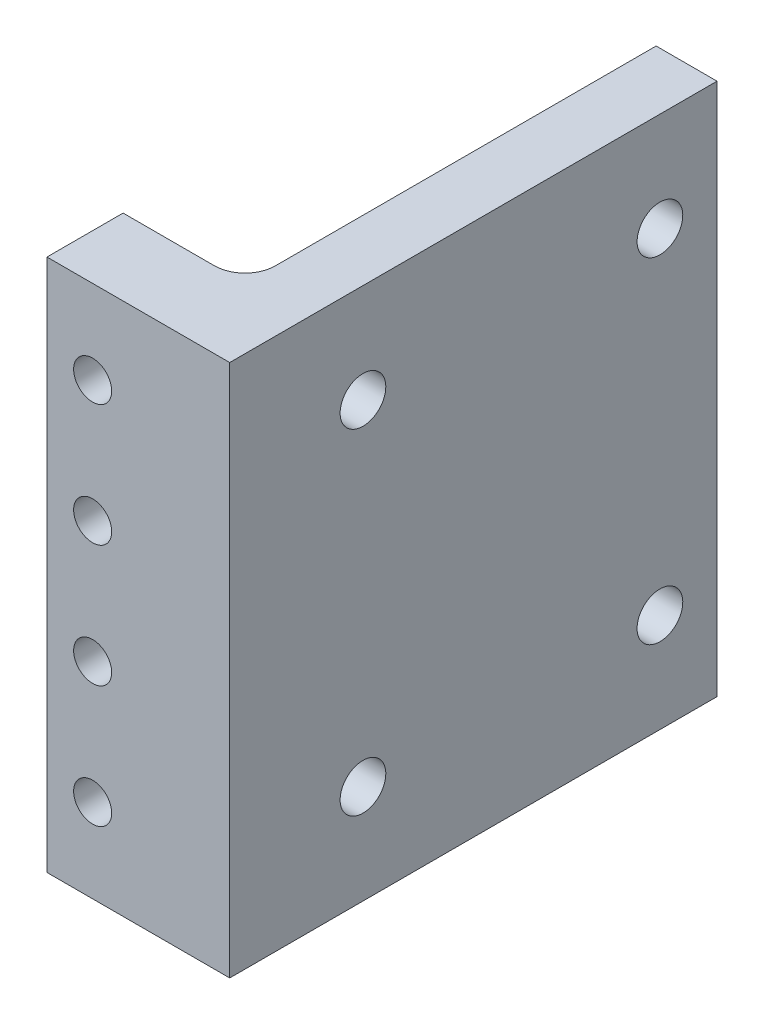
ISO-10303-21;
HEADER;
FILE_DESCRIPTION(('STEP AP214'),'2;1');
FILE_NAME('part.step','',(''),(''),'','','');
FILE_SCHEMA(('AUTOMOTIVE_DESIGN { 1 0 10303 214 1 1 1 1 }'));
ENDSEC;
DATA;
#1=APPLICATION_CONTEXT('core data for automotive mechanical design processes');
#2=APPLICATION_PROTOCOL_DEFINITION('international standard','automotive_design',2000,#1);
#3=PRODUCT_CONTEXT('',#1,'mechanical');
#4=PRODUCT('Part','Part','',(#3));
#5=PRODUCT_RELATED_PRODUCT_CATEGORY('part','',(#4));
#6=PRODUCT_DEFINITION_FORMATION('','',#4);
#7=PRODUCT_DEFINITION_CONTEXT('part definition',#1,'design');
#8=PRODUCT_DEFINITION('design','',#6,#7);
#9=PRODUCT_DEFINITION_SHAPE('','',#8);
#10=(LENGTH_UNIT() NAMED_UNIT(*) SI_UNIT(.MILLI.,.METRE.));
#11=(NAMED_UNIT(*) PLANE_ANGLE_UNIT() SI_UNIT($,.RADIAN.));
#12=(NAMED_UNIT(*) SI_UNIT($,.STERADIAN.) SOLID_ANGLE_UNIT());
#13=UNCERTAINTY_MEASURE_WITH_UNIT(LENGTH_MEASURE(1.E-05),#10,'distance_accuracy_value','');
#14=(GEOMETRIC_REPRESENTATION_CONTEXT(3) GLOBAL_UNCERTAINTY_ASSIGNED_CONTEXT((#13)) GLOBAL_UNIT_ASSIGNED_CONTEXT((#10,
#11,#12)) REPRESENTATION_CONTEXT('',''));
#15=CARTESIAN_POINT('',(0.,0.,0.));
#16=DIRECTION('',(0.,0.,1.));
#17=DIRECTION('',(1.,0.,0.));
#18=AXIS2_PLACEMENT_3D('',#15,#16,#17);
#19=CARTESIAN_POINT('',(0.,0.,0.));
#20=DIRECTION('',(0.,0.,1.));
#21=DIRECTION('',(1.,0.,0.));
#22=AXIS2_PLACEMENT_3D('',#19,#20,#21);
#23=PLANE('',#22);
#24=CARTESIAN_POINT('',(3.00000000000008,5.5,0.));
#25=DIRECTION('',(0.,0.,1.));
#26=DIRECTION('',(1.,0.,0.));
#27=AXIS2_PLACEMENT_3D('',#24,#25,#26);
#28=CIRCLE('',#27,1.25);
#29=CARTESIAN_POINT('',(4.25000000000008,5.5,0.));
#30=VERTEX_POINT('',#29);
#31=EDGE_CURVE('E126',#30,#30,#28,.T.);
#32=ORIENTED_EDGE('',*,*,#31,.T.);
#33=EDGE_LOOP('',(#32));
#34=FACE_BOUND('',#33,.T.);
#35=CARTESIAN_POINT('',(3.00000000000006,13.5,0.));
#36=DIRECTION('',(0.,0.,1.));
#37=DIRECTION('',(1.,0.,0.));
#38=AXIS2_PLACEMENT_3D('',#35,#36,#37);
#39=CIRCLE('',#38,1.25);
#40=CARTESIAN_POINT('',(4.25000000000006,13.5,0.));
#41=VERTEX_POINT('',#40);
#42=EDGE_CURVE('E131',#41,#41,#39,.T.);
#43=ORIENTED_EDGE('',*,*,#42,.T.);
#44=EDGE_LOOP('',(#43));
#45=FACE_BOUND('',#44,.T.);
#46=CARTESIAN_POINT('',(3.00000000000003,21.5,0.));
#47=DIRECTION('',(0.,0.,1.));
#48=DIRECTION('',(1.,0.,0.));
#49=AXIS2_PLACEMENT_3D('',#46,#47,#48);
#50=CIRCLE('',#49,1.25);
#51=CARTESIAN_POINT('',(4.25000000000003,21.5,0.));
#52=VERTEX_POINT('',#51);
#53=EDGE_CURVE('E278',#52,#52,#50,.T.);
#54=ORIENTED_EDGE('',*,*,#53,.T.);
#55=EDGE_LOOP('',(#54));
#56=FACE_BOUND('',#55,.T.);
#57=CARTESIAN_POINT('',(3.,29.5,0.));
#58=DIRECTION('',(0.,0.,1.));
#59=DIRECTION('',(1.,0.,0.));
#60=AXIS2_PLACEMENT_3D('',#57,#58,#59);
#61=CIRCLE('',#60,1.25);
#62=CARTESIAN_POINT('',(4.25,29.5,0.));
#63=VERTEX_POINT('',#62);
#64=EDGE_CURVE('E283',#63,#63,#61,.T.);
#65=ORIENTED_EDGE('',*,*,#64,.T.);
#66=EDGE_LOOP('',(#65));
#67=FACE_BOUND('',#66,.T.);
#68=DIRECTION('',(-1.,0.,0.));
#69=VECTOR('',#68,1.);
#70=CARTESIAN_POINT('',(0.,35.,0.));
#71=LINE('',#70,#69);
#72=CARTESIAN_POINT('',(6.,35.,0.));
#73=VERTEX_POINT('',#72);
#74=CARTESIAN_POINT('',(0.,35.,0.));
#75=VERTEX_POINT('',#74);
#76=EDGE_CURVE('E150',#73,#75,#71,.T.);
#77=ORIENTED_EDGE('',*,*,#76,.F.);
#78=DIRECTION('',(0.,1.,0.));
#79=VECTOR('',#78,1.);
#80=CARTESIAN_POINT('',(6.,0.,0.));
#81=LINE('',#80,#79);
#82=CARTESIAN_POINT('',(6.,0.,0.));
#83=VERTEX_POINT('',#82);
#84=EDGE_CURVE('E62',#73,#83,#81,.F.);
#85=ORIENTED_EDGE('',*,*,#84,.T.);
#86=DIRECTION('',(1.,0.,0.));
#87=VECTOR('',#86,1.);
#88=CARTESIAN_POINT('',(0.,0.,0.));
#89=LINE('',#88,#87);
#90=CARTESIAN_POINT('',(0.,0.,0.));
#91=VERTEX_POINT('',#90);
#92=EDGE_CURVE('E162',#91,#83,#89,.T.);
#93=ORIENTED_EDGE('',*,*,#92,.F.);
#94=DIRECTION('',(0.,-1.,0.));
#95=VECTOR('',#94,1.);
#96=CARTESIAN_POINT('',(0.,35.,0.));
#97=LINE('',#96,#95);
#98=EDGE_CURVE('E144',#75,#91,#97,.T.);
#99=ORIENTED_EDGE('',*,*,#98,.F.);
#100=EDGE_LOOP('',(#77,#85,#93,#99));
#101=FACE_BOUND('',#100,.T.);
#102=ADVANCED_FACE('F40',(#34,#45,#56,#67,#101),#23,.F.);
#103=CARTESIAN_POINT('',(0.,35.,5.));
#104=DIRECTION('',(1.,0.,0.));
#105=DIRECTION('',(0.,1.,0.));
#106=AXIS2_PLACEMENT_3D('',#103,#104,#105);
#107=PLANE('',#106);
#108=ORIENTED_EDGE('',*,*,#98,.T.);
#109=DIRECTION('',(0.,0.,-1.));
#110=VECTOR('',#109,1.);
#111=CARTESIAN_POINT('',(0.,0.,5.));
#112=LINE('',#111,#110);
#113=CARTESIAN_POINT('',(0.,0.,5.));
#114=VERTEX_POINT('',#113);
#115=EDGE_CURVE('E108',#114,#91,#112,.T.);
#116=ORIENTED_EDGE('',*,*,#115,.F.);
#117=DIRECTION('',(0.,-1.,0.));
#118=VECTOR('',#117,1.);
#119=CARTESIAN_POINT('',(0.,35.,5.));
#120=LINE('',#119,#118);
#121=CARTESIAN_POINT('',(0.,35.,5.));
#122=VERTEX_POINT('',#121);
#123=EDGE_CURVE('E145',#122,#114,#120,.T.);
#124=ORIENTED_EDGE('',*,*,#123,.F.);
#125=DIRECTION('',(0.,0.,-1.));
#126=VECTOR('',#125,1.);
#127=CARTESIAN_POINT('',(0.,35.,5.));
#128=LINE('',#127,#126);
#129=EDGE_CURVE('E158',#122,#75,#128,.T.);
#130=ORIENTED_EDGE('',*,*,#129,.T.);
#131=EDGE_LOOP('',(#108,#116,#124,#130));
#132=FACE_BOUND('',#131,.T.);
#133=ADVANCED_FACE('F418',(#132),#107,.F.);
#134=CARTESIAN_POINT('',(0.,0.,5.));
#135=DIRECTION('',(0.,1.,0.));
#136=DIRECTION('',(0.,0.,1.));
#137=AXIS2_PLACEMENT_3D('',#134,#135,#136);
#138=PLANE('',#137);
#139=ORIENTED_EDGE('',*,*,#92,.T.);
#140=CARTESIAN_POINT('',(6.,0.,-2.));
#141=DIRECTION('',(0.,1.,0.));
#142=DIRECTION('',(0.,0.,1.));
#143=AXIS2_PLACEMENT_3D('',#140,#141,#142);
#144=CIRCLE('',#143,2.);
#145=CARTESIAN_POINT('',(8.,0.,-2.));
#146=VERTEX_POINT('',#145);
#147=EDGE_CURVE('E11',#83,#146,#144,.T.);
#148=ORIENTED_EDGE('',*,*,#147,.T.);
#149=DIRECTION('',(0.,0.,1.));
#150=VECTOR('',#149,1.);
#151=CARTESIAN_POINT('',(8.,0.,-27.));
#152=LINE('',#151,#150);
#153=CARTESIAN_POINT('',(8.,0.,-27.));
#154=VERTEX_POINT('',#153);
#155=EDGE_CURVE('E115',#154,#146,#152,.T.);
#156=ORIENTED_EDGE('',*,*,#155,.F.);
#157=DIRECTION('',(-1.,0.,0.));
#158=VECTOR('',#157,1.);
#159=CARTESIAN_POINT('',(12.,0.,-27.));
#160=LINE('',#159,#158);
#161=CARTESIAN_POINT('',(12.,0.,-27.));
#162=VERTEX_POINT('',#161);
#163=EDGE_CURVE('E112',#162,#154,#160,.T.);
#164=ORIENTED_EDGE('',*,*,#163,.F.);
#165=DIRECTION('',(0.,0.,-1.));
#166=VECTOR('',#165,1.);
#167=CARTESIAN_POINT('',(12.,0.,5.));
#168=LINE('',#167,#166);
#169=CARTESIAN_POINT('',(12.,0.,5.));
#170=VERTEX_POINT('',#169);
#171=EDGE_CURVE('E99',#170,#162,#168,.T.);
#172=ORIENTED_EDGE('',*,*,#171,.F.);
#173=DIRECTION('',(1.,0.,0.));
#174=VECTOR('',#173,1.);
#175=CARTESIAN_POINT('',(0.,0.,5.));
#176=LINE('',#175,#174);
#177=EDGE_CURVE('E149',#114,#170,#176,.T.);
#178=ORIENTED_EDGE('',*,*,#177,.F.);
#179=ORIENTED_EDGE('',*,*,#115,.T.);
#180=EDGE_LOOP('',(#139,#148,#156,#164,#172,#178,#179));
#181=FACE_BOUND('',#180,.T.);
#182=ADVANCED_FACE('F113',(#181),#138,.F.);
#183=CARTESIAN_POINT('',(12.,0.,5.));
#184=DIRECTION('',(-1.,0.,0.));
#185=DIRECTION('',(0.,0.,1.));
#186=AXIS2_PLACEMENT_3D('',#183,#184,#185);
#187=PLANE('',#186);
#188=CARTESIAN_POINT('',(12.,28.5,-3.75));
#189=DIRECTION('',(-1.,0.,0.));
#190=DIRECTION('',(0.,-1.,0.));
#191=AXIS2_PLACEMENT_3D('',#188,#189,#190);
#192=CIRCLE('',#191,1.5);
#193=CARTESIAN_POINT('',(12.,27.,-3.75));
#194=VERTEX_POINT('',#193);
#195=EDGE_CURVE('E365',#194,#194,#192,.T.);
#196=ORIENTED_EDGE('',*,*,#195,.T.);
#197=EDGE_LOOP('',(#196));
#198=FACE_BOUND('',#197,.T.);
#199=CARTESIAN_POINT('',(12.,6.5,-23.25));
#200=DIRECTION('',(-1.,0.,0.));
#201=DIRECTION('',(0.,-1.,0.));
#202=AXIS2_PLACEMENT_3D('',#199,#200,#201);
#203=CIRCLE('',#202,1.5);
#204=CARTESIAN_POINT('',(12.,5.,-23.25));
#205=VERTEX_POINT('',#204);
#206=EDGE_CURVE('E377',#205,#205,#203,.T.);
#207=ORIENTED_EDGE('',*,*,#206,.T.);
#208=EDGE_LOOP('',(#207));
#209=FACE_BOUND('',#208,.T.);
#210=CARTESIAN_POINT('',(12.,6.5,-3.75));
#211=DIRECTION('',(-1.,0.,0.));
#212=DIRECTION('',(0.,-1.,0.));
#213=AXIS2_PLACEMENT_3D('',#210,#211,#212);
#214=CIRCLE('',#213,1.5);
#215=CARTESIAN_POINT('',(12.,5.,-3.75));
#216=VERTEX_POINT('',#215);
#217=EDGE_CURVE('E389',#216,#216,#214,.T.);
#218=ORIENTED_EDGE('',*,*,#217,.T.);
#219=EDGE_LOOP('',(#218));
#220=FACE_BOUND('',#219,.T.);
#221=CARTESIAN_POINT('',(12.,28.5,-23.25));
#222=DIRECTION('',(-1.,0.,0.));
#223=DIRECTION('',(0.,-1.,0.));
#224=AXIS2_PLACEMENT_3D('',#221,#222,#223);
#225=CIRCLE('',#224,1.5);
#226=CARTESIAN_POINT('',(12.,27.,-23.25));
#227=VERTEX_POINT('',#226);
#228=EDGE_CURVE('E313',#227,#227,#225,.T.);
#229=ORIENTED_EDGE('',*,*,#228,.T.);
#230=EDGE_LOOP('',(#229));
#231=FACE_BOUND('',#230,.T.);
#232=ORIENTED_EDGE('',*,*,#171,.T.);
#233=DIRECTION('',(0.,-1.,0.));
#234=VECTOR('',#233,1.);
#235=CARTESIAN_POINT('',(12.,35.,-27.));
#236=LINE('',#235,#234);
#237=CARTESIAN_POINT('',(12.,35.,-27.));
#238=VERTEX_POINT('',#237);
#239=EDGE_CURVE('E104',#238,#162,#236,.T.);
#240=ORIENTED_EDGE('',*,*,#239,.F.);
#241=DIRECTION('',(0.,0.,-1.));
#242=VECTOR('',#241,1.);
#243=CARTESIAN_POINT('',(12.,35.,5.));
#244=LINE('',#243,#242);
#245=CARTESIAN_POINT('',(12.,35.,5.));
#246=VERTEX_POINT('',#245);
#247=EDGE_CURVE('E109',#246,#238,#244,.T.);
#248=ORIENTED_EDGE('',*,*,#247,.F.);
#249=DIRECTION('',(0.,1.,0.));
#250=VECTOR('',#249,1.);
#251=CARTESIAN_POINT('',(12.,0.,5.));
#252=LINE('',#251,#250);
#253=EDGE_CURVE('E105',#170,#246,#252,.T.);
#254=ORIENTED_EDGE('',*,*,#253,.F.);
#255=EDGE_LOOP('',(#232,#240,#248,#254));
#256=FACE_BOUND('',#255,.T.);
#257=ADVANCED_FACE('F101',(#198,#209,#220,#231,#256),#187,.F.);
#258=CARTESIAN_POINT('',(0.,35.,5.));
#259=DIRECTION('',(0.,-1.,0.));
#260=DIRECTION('',(0.,0.,-1.));
#261=AXIS2_PLACEMENT_3D('',#258,#259,#260);
#262=PLANE('',#261);
#263=ORIENTED_EDGE('',*,*,#247,.T.);
#264=DIRECTION('',(1.,0.,0.));
#265=VECTOR('',#264,1.);
#266=CARTESIAN_POINT('',(12.,35.,-27.));
#267=LINE('',#266,#265);
#268=CARTESIAN_POINT('',(8.,35.,-27.));
#269=VERTEX_POINT('',#268);
#270=EDGE_CURVE('E124',#269,#238,#267,.T.);
#271=ORIENTED_EDGE('',*,*,#270,.F.);
#272=DIRECTION('',(0.,0.,1.));
#273=VECTOR('',#272,1.);
#274=CARTESIAN_POINT('',(8.,35.,-27.));
#275=LINE('',#274,#273);
#276=CARTESIAN_POINT('',(8.,35.,-2.));
#277=VERTEX_POINT('',#276);
#278=EDGE_CURVE('E139',#269,#277,#275,.T.);
#279=ORIENTED_EDGE('',*,*,#278,.T.);
#280=CARTESIAN_POINT('',(6.,35.,-2.));
#281=DIRECTION('',(0.,-1.,0.));
#282=DIRECTION('',(0.,0.,-1.));
#283=AXIS2_PLACEMENT_3D('',#280,#281,#282);
#284=CIRCLE('',#283,2.);
#285=EDGE_CURVE('E49',#277,#73,#284,.T.);
#286=ORIENTED_EDGE('',*,*,#285,.T.);
#287=ORIENTED_EDGE('',*,*,#76,.T.);
#288=ORIENTED_EDGE('',*,*,#129,.F.);
#289=DIRECTION('',(-1.,0.,0.));
#290=VECTOR('',#289,1.);
#291=CARTESIAN_POINT('',(0.,35.,5.));
#292=LINE('',#291,#290);
#293=EDGE_CURVE('E155',#246,#122,#292,.T.);
#294=ORIENTED_EDGE('',*,*,#293,.F.);
#295=EDGE_LOOP('',(#263,#271,#279,#286,#287,#288,#294));
#296=FACE_BOUND('',#295,.T.);
#297=ADVANCED_FACE('F422',(#296),#262,.F.);
#298=CARTESIAN_POINT('',(0.,0.,5.));
#299=DIRECTION('',(0.,0.,1.));
#300=DIRECTION('',(1.,0.,0.));
#301=AXIS2_PLACEMENT_3D('',#298,#299,#300);
#302=PLANE('',#301);
#303=CARTESIAN_POINT('',(3.00000000000008,5.5,5.));
#304=DIRECTION('',(0.,0.,1.));
#305=DIRECTION('',(1.,0.,0.));
#306=AXIS2_PLACEMENT_3D('',#303,#304,#305);
#307=CIRCLE('',#306,1.25);
#308=CARTESIAN_POINT('',(4.25000000000008,5.5,5.));
#309=VERTEX_POINT('',#308);
#310=EDGE_CURVE('E289',#309,#309,#307,.T.);
#311=ORIENTED_EDGE('',*,*,#310,.F.);
#312=EDGE_LOOP('',(#311));
#313=FACE_BOUND('',#312,.T.);
#314=CARTESIAN_POINT('',(3.00000000000006,13.5,5.));
#315=DIRECTION('',(0.,0.,1.));
#316=DIRECTION('',(1.,0.,0.));
#317=AXIS2_PLACEMENT_3D('',#314,#315,#316);
#318=CIRCLE('',#317,1.25);
#319=CARTESIAN_POINT('',(4.25000000000006,13.5,5.));
#320=VERTEX_POINT('',#319);
#321=EDGE_CURVE('E295',#320,#320,#318,.T.);
#322=ORIENTED_EDGE('',*,*,#321,.F.);
#323=EDGE_LOOP('',(#322));
#324=FACE_BOUND('',#323,.T.);
#325=CARTESIAN_POINT('',(3.00000000000003,21.5,5.));
#326=DIRECTION('',(0.,0.,1.));
#327=DIRECTION('',(1.,0.,0.));
#328=AXIS2_PLACEMENT_3D('',#325,#326,#327);
#329=CIRCLE('',#328,1.25);
#330=CARTESIAN_POINT('',(4.25000000000003,21.5,5.));
#331=VERTEX_POINT('',#330);
#332=EDGE_CURVE('E301',#331,#331,#329,.T.);
#333=ORIENTED_EDGE('',*,*,#332,.F.);
#334=EDGE_LOOP('',(#333));
#335=FACE_BOUND('',#334,.T.);
#336=CARTESIAN_POINT('',(3.,29.5,5.));
#337=DIRECTION('',(0.,0.,1.));
#338=DIRECTION('',(1.,0.,0.));
#339=AXIS2_PLACEMENT_3D('',#336,#337,#338);
#340=CIRCLE('',#339,1.25);
#341=CARTESIAN_POINT('',(4.25,29.5,5.));
#342=VERTEX_POINT('',#341);
#343=EDGE_CURVE('E307',#342,#342,#340,.T.);
#344=ORIENTED_EDGE('',*,*,#343,.F.);
#345=EDGE_LOOP('',(#344));
#346=FACE_BOUND('',#345,.T.);
#347=ORIENTED_EDGE('',*,*,#123,.T.);
#348=ORIENTED_EDGE('',*,*,#177,.T.);
#349=ORIENTED_EDGE('',*,*,#253,.T.);
#350=ORIENTED_EDGE('',*,*,#293,.T.);
#351=EDGE_LOOP('',(#347,#348,#349,#350));
#352=FACE_BOUND('',#351,.T.);
#353=ADVANCED_FACE('F406',(#313,#324,#335,#346,#352),#302,.T.);
#354=CARTESIAN_POINT('',(8.,35.,-27.));
#355=DIRECTION('',(1.,0.,0.));
#356=DIRECTION('',(0.,1.,0.));
#357=AXIS2_PLACEMENT_3D('',#354,#355,#356);
#358=PLANE('',#357);
#359=CARTESIAN_POINT('',(8.,28.5,-3.75));
#360=DIRECTION('',(-1.,0.,0.));
#361=DIRECTION('',(0.,-1.,0.));
#362=AXIS2_PLACEMENT_3D('',#359,#360,#361);
#363=CIRCLE('',#362,1.5);
#364=CARTESIAN_POINT('',(8.,27.,-3.75));
#365=VERTEX_POINT('',#364);
#366=EDGE_CURVE('E371',#365,#365,#363,.T.);
#367=ORIENTED_EDGE('',*,*,#366,.F.);
#368=EDGE_LOOP('',(#367));
#369=FACE_BOUND('',#368,.T.);
#370=CARTESIAN_POINT('',(8.,6.5,-23.25));
#371=DIRECTION('',(-1.,0.,0.));
#372=DIRECTION('',(0.,-1.,0.));
#373=AXIS2_PLACEMENT_3D('',#370,#371,#372);
#374=CIRCLE('',#373,1.5);
#375=CARTESIAN_POINT('',(8.,5.,-23.25));
#376=VERTEX_POINT('',#375);
#377=EDGE_CURVE('E383',#376,#376,#374,.T.);
#378=ORIENTED_EDGE('',*,*,#377,.F.);
#379=EDGE_LOOP('',(#378));
#380=FACE_BOUND('',#379,.T.);
#381=CARTESIAN_POINT('',(8.,6.5,-3.75));
#382=DIRECTION('',(-1.,0.,0.));
#383=DIRECTION('',(0.,-1.,0.));
#384=AXIS2_PLACEMENT_3D('',#381,#382,#383);
#385=CIRCLE('',#384,1.5);
#386=CARTESIAN_POINT('',(8.,5.,-3.75));
#387=VERTEX_POINT('',#386);
#388=EDGE_CURVE('E394',#387,#387,#385,.T.);
#389=ORIENTED_EDGE('',*,*,#388,.F.);
#390=EDGE_LOOP('',(#389));
#391=FACE_BOUND('',#390,.T.);
#392=CARTESIAN_POINT('',(8.,28.5,-23.25));
#393=DIRECTION('',(-1.,0.,0.));
#394=DIRECTION('',(0.,-1.,0.));
#395=AXIS2_PLACEMENT_3D('',#392,#393,#394);
#396=CIRCLE('',#395,1.5);
#397=CARTESIAN_POINT('',(8.,27.,-23.25));
#398=VERTEX_POINT('',#397);
#399=EDGE_CURVE('E359',#398,#398,#396,.T.);
#400=ORIENTED_EDGE('',*,*,#399,.F.);
#401=EDGE_LOOP('',(#400));
#402=FACE_BOUND('',#401,.T.);
#403=ORIENTED_EDGE('',*,*,#155,.T.);
#404=DIRECTION('',(0.,1.,0.));
#405=VECTOR('',#404,1.);
#406=CARTESIAN_POINT('',(8.,35.,-2.));
#407=LINE('',#406,#405);
#408=EDGE_CURVE('E175',#146,#277,#407,.T.);
#409=ORIENTED_EDGE('',*,*,#408,.T.);
#410=ORIENTED_EDGE('',*,*,#278,.F.);
#411=DIRECTION('',(0.,1.,0.));
#412=VECTOR('',#411,1.);
#413=CARTESIAN_POINT('',(8.,35.,-27.));
#414=LINE('',#413,#412);
#415=EDGE_CURVE('E119',#154,#269,#414,.T.);
#416=ORIENTED_EDGE('',*,*,#415,.F.);
#417=EDGE_LOOP('',(#403,#409,#410,#416));
#418=FACE_BOUND('',#417,.T.);
#419=ADVANCED_FACE('F403',(#369,#380,#391,#402,#418),#358,.F.);
#420=CARTESIAN_POINT('',(0.,0.,-27.));
#421=DIRECTION('',(0.,0.,-1.));
#422=DIRECTION('',(-1.,0.,0.));
#423=AXIS2_PLACEMENT_3D('',#420,#421,#422);
#424=PLANE('',#423);
#425=ORIENTED_EDGE('',*,*,#239,.T.);
#426=ORIENTED_EDGE('',*,*,#163,.T.);
#427=ORIENTED_EDGE('',*,*,#415,.T.);
#428=ORIENTED_EDGE('',*,*,#270,.T.);
#429=EDGE_LOOP('',(#425,#426,#427,#428));
#430=FACE_BOUND('',#429,.T.);
#431=ADVANCED_FACE('F122',(#430),#424,.T.);
#432=CARTESIAN_POINT('',(3.,29.5,-27.));
#433=DIRECTION('',(0.,0.,1.));
#434=DIRECTION('',(1.,0.,0.));
#435=AXIS2_PLACEMENT_3D('',#432,#433,#434);
#436=CYLINDRICAL_SURFACE('',#435,1.25);
#437=ORIENTED_EDGE('',*,*,#343,.T.);
#438=EDGE_LOOP('',(#437));
#439=FACE_BOUND('',#438,.T.);
#440=ORIENTED_EDGE('',*,*,#64,.F.);
#441=EDGE_LOOP('',(#440));
#442=FACE_BOUND('',#441,.T.);
#443=ADVANCED_FACE('F227',(#439,#442),#436,.F.);
#444=CARTESIAN_POINT('',(3.00000000000003,21.5,-27.));
#445=DIRECTION('',(0.,0.,1.));
#446=DIRECTION('',(1.,0.,0.));
#447=AXIS2_PLACEMENT_3D('',#444,#445,#446);
#448=CYLINDRICAL_SURFACE('',#447,1.25);
#449=ORIENTED_EDGE('',*,*,#332,.T.);
#450=EDGE_LOOP('',(#449));
#451=FACE_BOUND('',#450,.T.);
#452=ORIENTED_EDGE('',*,*,#53,.F.);
#453=EDGE_LOOP('',(#452));
#454=FACE_BOUND('',#453,.T.);
#455=ADVANCED_FACE('F233',(#451,#454),#448,.F.);
#456=CARTESIAN_POINT('',(3.00000000000006,13.5,-27.));
#457=DIRECTION('',(0.,0.,1.));
#458=DIRECTION('',(1.,0.,0.));
#459=AXIS2_PLACEMENT_3D('',#456,#457,#458);
#460=CYLINDRICAL_SURFACE('',#459,1.25);
#461=ORIENTED_EDGE('',*,*,#321,.T.);
#462=EDGE_LOOP('',(#461));
#463=FACE_BOUND('',#462,.T.);
#464=ORIENTED_EDGE('',*,*,#42,.F.);
#465=EDGE_LOOP('',(#464));
#466=FACE_BOUND('',#465,.T.);
#467=ADVANCED_FACE('F245',(#463,#466),#460,.F.);
#468=CARTESIAN_POINT('',(3.00000000000008,5.5,-27.));
#469=DIRECTION('',(0.,0.,1.));
#470=DIRECTION('',(1.,0.,0.));
#471=AXIS2_PLACEMENT_3D('',#468,#469,#470);
#472=CYLINDRICAL_SURFACE('',#471,1.25);
#473=ORIENTED_EDGE('',*,*,#310,.T.);
#474=EDGE_LOOP('',(#473));
#475=FACE_BOUND('',#474,.T.);
#476=ORIENTED_EDGE('',*,*,#31,.F.);
#477=EDGE_LOOP('',(#476));
#478=FACE_BOUND('',#477,.T.);
#479=ADVANCED_FACE('F255',(#475,#478),#472,.F.);
#480=CARTESIAN_POINT('',(12.,28.5,-23.25));
#481=DIRECTION('',(-1.,0.,0.));
#482=DIRECTION('',(0.,-1.,0.));
#483=AXIS2_PLACEMENT_3D('',#480,#481,#482);
#484=CYLINDRICAL_SURFACE('',#483,1.5);
#485=ORIENTED_EDGE('',*,*,#228,.F.);
#486=EDGE_LOOP('',(#485));
#487=FACE_BOUND('',#486,.T.);
#488=ORIENTED_EDGE('',*,*,#399,.T.);
#489=EDGE_LOOP('',(#488));
#490=FACE_BOUND('',#489,.T.);
#491=ADVANCED_FACE('F265',(#487,#490),#484,.F.);
#492=CARTESIAN_POINT('',(12.,6.5,-3.75));
#493=DIRECTION('',(-1.,0.,0.));
#494=DIRECTION('',(0.,-1.,0.));
#495=AXIS2_PLACEMENT_3D('',#492,#493,#494);
#496=CYLINDRICAL_SURFACE('',#495,1.5);
#497=ORIENTED_EDGE('',*,*,#217,.F.);
#498=EDGE_LOOP('',(#497));
#499=FACE_BOUND('',#498,.T.);
#500=ORIENTED_EDGE('',*,*,#388,.T.);
#501=EDGE_LOOP('',(#500));
#502=FACE_BOUND('',#501,.T.);
#503=ADVANCED_FACE('F320',(#499,#502),#496,.F.);
#504=CARTESIAN_POINT('',(12.,6.5,-23.25));
#505=DIRECTION('',(-1.,0.,0.));
#506=DIRECTION('',(0.,-1.,0.));
#507=AXIS2_PLACEMENT_3D('',#504,#505,#506);
#508=CYLINDRICAL_SURFACE('',#507,1.5);
#509=ORIENTED_EDGE('',*,*,#206,.F.);
#510=EDGE_LOOP('',(#509));
#511=FACE_BOUND('',#510,.T.);
#512=ORIENTED_EDGE('',*,*,#377,.T.);
#513=EDGE_LOOP('',(#512));
#514=FACE_BOUND('',#513,.T.);
#515=ADVANCED_FACE('F330',(#511,#514),#508,.F.);
#516=CARTESIAN_POINT('',(12.,28.5,-3.75));
#517=DIRECTION('',(-1.,0.,0.));
#518=DIRECTION('',(0.,-1.,0.));
#519=AXIS2_PLACEMENT_3D('',#516,#517,#518);
#520=CYLINDRICAL_SURFACE('',#519,1.5);
#521=ORIENTED_EDGE('',*,*,#195,.F.);
#522=EDGE_LOOP('',(#521));
#523=FACE_BOUND('',#522,.T.);
#524=ORIENTED_EDGE('',*,*,#366,.T.);
#525=EDGE_LOOP('',(#524));
#526=FACE_BOUND('',#525,.T.);
#527=ADVANCED_FACE('F340',(#523,#526),#520,.F.);
#528=CARTESIAN_POINT('',(6.,35.,-2.));
#529=DIRECTION('',(0.,-1.,0.));
#530=DIRECTION('',(1.,0.,0.));
#531=AXIS2_PLACEMENT_3D('',#528,#529,#530);
#532=CYLINDRICAL_SURFACE('',#531,2.);
#533=ORIENTED_EDGE('',*,*,#147,.F.);
#534=ORIENTED_EDGE('',*,*,#84,.F.);
#535=ORIENTED_EDGE('',*,*,#285,.F.);
#536=ORIENTED_EDGE('',*,*,#408,.F.);
#537=EDGE_LOOP('',(#533,#534,#535,#536));
#538=FACE_BOUND('',#537,.T.);
#539=ADVANCED_FACE('F42',(#538),#532,.F.);
#540=CLOSED_SHELL('',(#102,#133,#182,#257,#297,#353,#419,#431,#443,#455,#467,#479,#491,#503,
#515,#527,#539));
#541=MANIFOLD_SOLID_BREP('B2',#540);
#542=ADVANCED_BREP_SHAPE_REPRESENTATION('',(#18,#541),#14);
#543=SHAPE_DEFINITION_REPRESENTATION(#9,#542);
ENDSEC;
END-ISO-10303-21;
